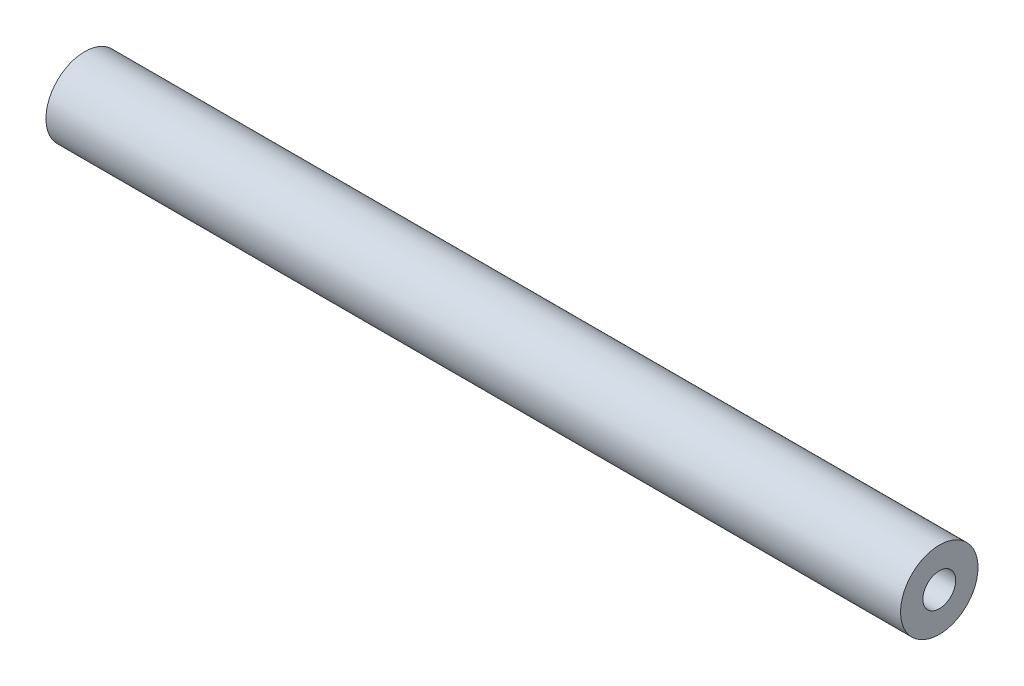
ISO-10303-21;
HEADER;
FILE_DESCRIPTION(('STEP AP214'),'2;1');
FILE_NAME('part.step','',(''),(''),'','','');
FILE_SCHEMA(('AUTOMOTIVE_DESIGN { 1 0 10303 214 1 1 1 1 }'));
ENDSEC;
DATA;
#1=APPLICATION_CONTEXT('core data for automotive mechanical design processes');
#2=APPLICATION_PROTOCOL_DEFINITION('international standard','automotive_design',2000,#1);
#3=PRODUCT_CONTEXT('',#1,'mechanical');
#4=PRODUCT('Part','Part','',(#3));
#5=PRODUCT_RELATED_PRODUCT_CATEGORY('part','',(#4));
#6=PRODUCT_DEFINITION_FORMATION('','',#4);
#7=PRODUCT_DEFINITION_CONTEXT('part definition',#1,'design');
#8=PRODUCT_DEFINITION('design','',#6,#7);
#9=PRODUCT_DEFINITION_SHAPE('','',#8);
#10=(LENGTH_UNIT() NAMED_UNIT(*) SI_UNIT(.MILLI.,.METRE.));
#11=(NAMED_UNIT(*) PLANE_ANGLE_UNIT() SI_UNIT($,.RADIAN.));
#12=(NAMED_UNIT(*) SI_UNIT($,.STERADIAN.) SOLID_ANGLE_UNIT());
#13=UNCERTAINTY_MEASURE_WITH_UNIT(LENGTH_MEASURE(1.E-05),#10,'distance_accuracy_value','');
#14=(GEOMETRIC_REPRESENTATION_CONTEXT(3) GLOBAL_UNCERTAINTY_ASSIGNED_CONTEXT((#13)) GLOBAL_UNIT_ASSIGNED_CONTEXT((#10,
#11,#12)) REPRESENTATION_CONTEXT('',''));
#15=CARTESIAN_POINT('',(0.,0.,0.));
#16=DIRECTION('',(0.,0.,1.));
#17=DIRECTION('',(1.,0.,0.));
#18=AXIS2_PLACEMENT_3D('',#15,#16,#17);
#19=CARTESIAN_POINT('',(105.156,0.,0.));
#20=DIRECTION('',(-1.,0.,0.));
#21=DIRECTION('',(0.,0.,1.));
#22=AXIS2_PLACEMENT_3D('',#19,#20,#21);
#23=CYLINDRICAL_SURFACE('',#22,4.7625);
#24=CARTESIAN_POINT('',(105.156,0.,0.));
#25=DIRECTION('',(1.,0.,0.));
#26=DIRECTION('',(0.,0.,-1.));
#27=AXIS2_PLACEMENT_3D('',#24,#25,#26);
#28=CIRCLE('',#27,4.7625);
#29=CARTESIAN_POINT('',(105.156,0.,-4.7625));
#30=VERTEX_POINT('',#29);
#31=EDGE_CURVE('E12',#30,#30,#28,.T.);
#32=ORIENTED_EDGE('',*,*,#31,.F.);
#33=EDGE_LOOP('',(#32));
#34=FACE_BOUND('',#33,.T.);
#35=CARTESIAN_POINT('',(0.,0.,0.));
#36=DIRECTION('',(1.,0.,0.));
#37=DIRECTION('',(0.,0.,-1.));
#38=AXIS2_PLACEMENT_3D('',#35,#36,#37);
#39=CIRCLE('',#38,4.7625);
#40=CARTESIAN_POINT('',(0.,0.,-4.7625));
#41=VERTEX_POINT('',#40);
#42=EDGE_CURVE('E56',#41,#41,#39,.T.);
#43=ORIENTED_EDGE('',*,*,#42,.T.);
#44=EDGE_LOOP('',(#43));
#45=FACE_BOUND('',#44,.T.);
#46=ADVANCED_FACE('F53',(#34,#45),#23,.T.);
#47=CARTESIAN_POINT('',(105.156,0.,0.));
#48=DIRECTION('',(1.,0.,0.));
#49=DIRECTION('',(0.,0.,-1.));
#50=AXIS2_PLACEMENT_3D('',#47,#48,#49);
#51=PLANE('',#50);
#52=CARTESIAN_POINT('',(105.156,0.,0.));
#53=DIRECTION('',(1.,0.,0.));
#54=DIRECTION('',(0.,0.,-1.));
#55=AXIS2_PLACEMENT_3D('',#52,#53,#54);
#56=CIRCLE('',#55,2.0193);
#57=CARTESIAN_POINT('',(105.156,0.,-2.0193));
#58=VERTEX_POINT('',#57);
#59=EDGE_CURVE('E71',#58,#58,#56,.T.);
#60=ORIENTED_EDGE('',*,*,#59,.F.);
#61=EDGE_LOOP('',(#60));
#62=FACE_BOUND('',#61,.T.);
#63=ORIENTED_EDGE('',*,*,#31,.T.);
#64=EDGE_LOOP('',(#63));
#65=FACE_BOUND('',#64,.T.);
#66=ADVANCED_FACE('F77',(#62,#65),#51,.T.);
#67=CARTESIAN_POINT('',(0.,0.,0.));
#68=DIRECTION('',(1.,0.,0.));
#69=DIRECTION('',(0.,0.,-1.));
#70=AXIS2_PLACEMENT_3D('',#67,#68,#69);
#71=PLANE('',#70);
#72=CARTESIAN_POINT('',(0.,0.,0.));
#73=DIRECTION('',(1.,0.,0.));
#74=DIRECTION('',(0.,0.,-1.));
#75=AXIS2_PLACEMENT_3D('',#72,#73,#74);
#76=CIRCLE('',#75,2.01929999999998);
#77=CARTESIAN_POINT('',(0.,0.,-2.01929999999998));
#78=VERTEX_POINT('',#77);
#79=EDGE_CURVE('E66',#78,#78,#76,.T.);
#80=ORIENTED_EDGE('',*,*,#79,.T.);
#81=EDGE_LOOP('',(#80));
#82=FACE_BOUND('',#81,.T.);
#83=ORIENTED_EDGE('',*,*,#42,.F.);
#84=EDGE_LOOP('',(#83));
#85=FACE_BOUND('',#84,.T.);
#86=ADVANCED_FACE('F79',(#82,#85),#71,.F.);
#87=CARTESIAN_POINT('',(105.156,0.,0.));
#88=DIRECTION('',(1.,0.,0.));
#89=DIRECTION('',(0.,0.,-1.));
#90=AXIS2_PLACEMENT_3D('',#87,#88,#89);
#91=CYLINDRICAL_SURFACE('',#90,2.01929999999999);
#92=ORIENTED_EDGE('',*,*,#79,.F.);
#93=EDGE_LOOP('',(#92));
#94=FACE_BOUND('',#93,.T.);
#95=ORIENTED_EDGE('',*,*,#59,.T.);
#96=EDGE_LOOP('',(#95));
#97=FACE_BOUND('',#96,.T.);
#98=ADVANCED_FACE('F75',(#94,#97),#91,.F.);
#99=CLOSED_SHELL('',(#46,#66,#86,#98));
#100=MANIFOLD_SOLID_BREP('B2',#99);
#101=ADVANCED_BREP_SHAPE_REPRESENTATION('',(#18,#100),#14);
#102=SHAPE_DEFINITION_REPRESENTATION(#9,#101);
ENDSEC;
END-ISO-10303-21;
